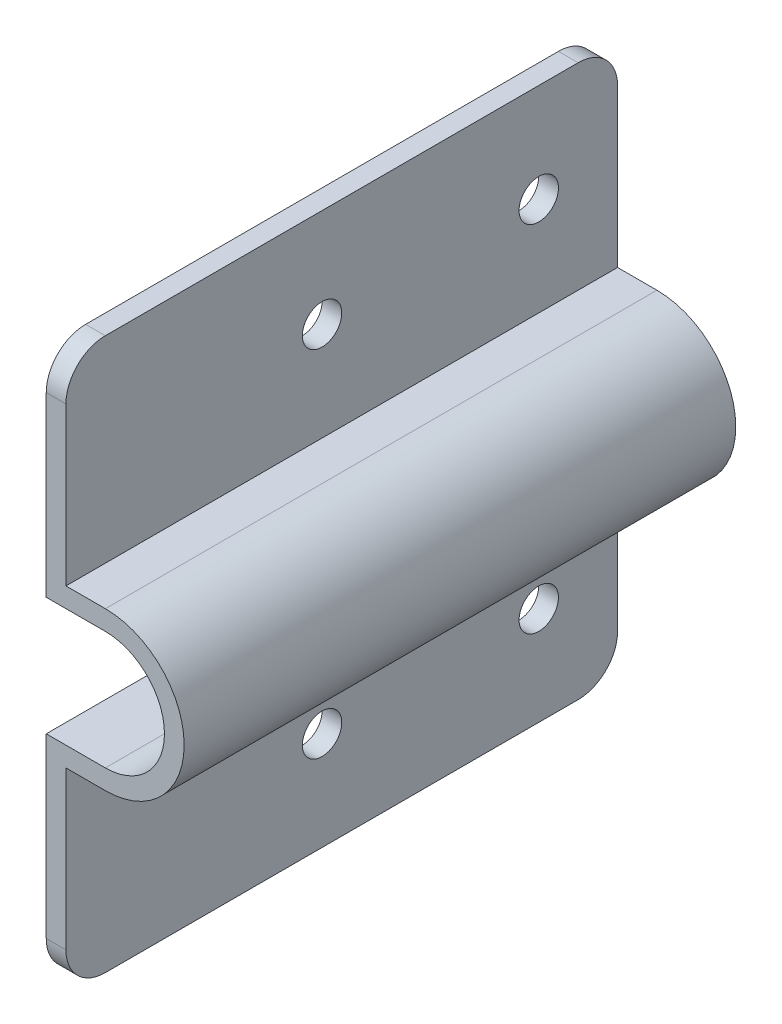
ISO-10303-21;
HEADER;
FILE_DESCRIPTION(('STEP AP214'),'2;1');
FILE_NAME('part.step','',(''),(''),'','','');
FILE_SCHEMA(('AUTOMOTIVE_DESIGN { 1 0 10303 214 1 1 1 1 }'));
ENDSEC;
DATA;
#1=APPLICATION_CONTEXT('core data for automotive mechanical design processes');
#2=APPLICATION_PROTOCOL_DEFINITION('international standard','automotive_design',2000,#1);
#3=PRODUCT_CONTEXT('',#1,'mechanical');
#4=PRODUCT('Part','Part','',(#3));
#5=PRODUCT_RELATED_PRODUCT_CATEGORY('part','',(#4));
#6=PRODUCT_DEFINITION_FORMATION('','',#4);
#7=PRODUCT_DEFINITION_CONTEXT('part definition',#1,'design');
#8=PRODUCT_DEFINITION('design','',#6,#7);
#9=PRODUCT_DEFINITION_SHAPE('','',#8);
#10=(LENGTH_UNIT() NAMED_UNIT(*) SI_UNIT(.MILLI.,.METRE.));
#11=(NAMED_UNIT(*) PLANE_ANGLE_UNIT() SI_UNIT($,.RADIAN.));
#12=(NAMED_UNIT(*) SI_UNIT($,.STERADIAN.) SOLID_ANGLE_UNIT());
#13=UNCERTAINTY_MEASURE_WITH_UNIT(LENGTH_MEASURE(1.E-05),#10,'distance_accuracy_value','');
#14=(GEOMETRIC_REPRESENTATION_CONTEXT(3) GLOBAL_UNCERTAINTY_ASSIGNED_CONTEXT((#13)) GLOBAL_UNIT_ASSIGNED_CONTEXT((#10,
#11,#12)) REPRESENTATION_CONTEXT('',''));
#15=CARTESIAN_POINT('',(0.,0.,0.));
#16=DIRECTION('',(0.,0.,1.));
#17=DIRECTION('',(1.,0.,0.));
#18=AXIS2_PLACEMENT_3D('',#15,#16,#17);
#19=CARTESIAN_POINT('',(0.,288.164397321974,-88.9));
#20=DIRECTION('',(0.,1.,0.));
#21=DIRECTION('',(0.,0.,1.));
#22=AXIS2_PLACEMENT_3D('',#19,#20,#21);
#23=PLANE('',#22);
#24=DIRECTION('',(-1.,0.,0.));
#25=VECTOR('',#24,1.);
#26=CARTESIAN_POINT('',(0.,288.164397321974,0.));
#27=LINE('',#26,#25);
#28=CARTESIAN_POINT('',(19.6849999999996,288.164397321974,0.));
#29=VERTEX_POINT('',#28);
#30=CARTESIAN_POINT('',(10.1599999999996,288.164397321974,0.));
#31=VERTEX_POINT('',#30);
#32=EDGE_CURVE('E221',#29,#31,#27,.T.);
#33=ORIENTED_EDGE('',*,*,#32,.T.);
#34=DIRECTION('',(0.,0.,1.));
#35=VECTOR('',#34,1.);
#36=CARTESIAN_POINT('',(10.1599999999996,288.164397321974,-88.9));
#37=LINE('',#36,#35);
#38=CARTESIAN_POINT('',(10.1599999999996,288.164397321974,-88.9));
#39=VERTEX_POINT('',#38);
#40=EDGE_CURVE('E182',#39,#31,#37,.T.);
#41=ORIENTED_EDGE('',*,*,#40,.F.);
#42=DIRECTION('',(-1.,0.,0.));
#43=VECTOR('',#42,1.);
#44=CARTESIAN_POINT('',(0.,288.164397321974,-88.9));
#45=LINE('',#44,#43);
#46=CARTESIAN_POINT('',(19.6849999999996,288.164397321974,-88.9));
#47=VERTEX_POINT('',#46);
#48=EDGE_CURVE('E161',#47,#39,#45,.T.);
#49=ORIENTED_EDGE('',*,*,#48,.F.);
#50=DIRECTION('',(0.,0.,1.));
#51=VECTOR('',#50,1.);
#52=CARTESIAN_POINT('',(19.6849999999996,288.164397321974,-88.9));
#53=LINE('',#52,#51);
#54=EDGE_CURVE('E170',#47,#29,#53,.T.);
#55=ORIENTED_EDGE('',*,*,#54,.T.);
#56=EDGE_LOOP('',(#33,#41,#49,#55));
#57=FACE_BOUND('',#56,.T.);
#58=ADVANCED_FACE('F40',(#57),#23,.F.);
#59=CARTESIAN_POINT('',(10.1599999999996,0.,-88.9));
#60=DIRECTION('',(-1.,0.,0.));
#61=DIRECTION('',(0.,-1.,0.));
#62=AXIS2_PLACEMENT_3D('',#59,#60,#61);
#63=PLANE('',#62);
#64=CARTESIAN_POINT('',(10.1599999999996,307.214397321974,-41.275));
#65=DIRECTION('',(1.,0.,0.));
#66=DIRECTION('',(0.,0.,-1.));
#67=AXIS2_PLACEMENT_3D('',#64,#65,#66);
#68=CIRCLE('',#67,3.175);
#69=CARTESIAN_POINT('',(10.1599999999996,307.214397321974,-44.45));
#70=VERTEX_POINT('',#69);
#71=EDGE_CURVE('E650',#70,#70,#68,.T.);
#72=ORIENTED_EDGE('',*,*,#71,.T.);
#73=EDGE_LOOP('',(#72));
#74=FACE_BOUND('',#73,.T.);
#75=CARTESIAN_POINT('',(10.1599999999996,307.214397321974,-76.2));
#76=DIRECTION('',(1.,0.,0.));
#77=DIRECTION('',(0.,0.,-1.));
#78=AXIS2_PLACEMENT_3D('',#75,#76,#77);
#79=CIRCLE('',#78,3.175);
#80=CARTESIAN_POINT('',(10.1599999999996,307.214397321974,-79.375));
#81=VERTEX_POINT('',#80);
#82=EDGE_CURVE('E649',#81,#81,#79,.T.);
#83=ORIENTED_EDGE('',*,*,#82,.T.);
#84=EDGE_LOOP('',(#83));
#85=FACE_BOUND('',#84,.T.);
#86=DIRECTION('',(0.,-1.,0.));
#87=VECTOR('',#86,1.);
#88=CARTESIAN_POINT('',(10.1599999999996,0.,0.));
#89=LINE('',#88,#87);
#90=CARTESIAN_POINT('',(10.1599999999996,316.739397321974,0.));
#91=VERTEX_POINT('',#90);
#92=EDGE_CURVE('E184',#91,#31,#89,.T.);
#93=ORIENTED_EDGE('',*,*,#92,.F.);
#94=CARTESIAN_POINT('',(10.1599999999996,316.739397321974,-6.34999999999999));
#95=DIRECTION('',(-1.,0.,0.));
#96=DIRECTION('',(0.,-1.,0.));
#97=AXIS2_PLACEMENT_3D('',#94,#95,#96);
#98=CIRCLE('',#97,6.35);
#99=CARTESIAN_POINT('',(10.1599999999996,323.089397321974,-6.34999999999999));
#100=VERTEX_POINT('',#99);
#101=EDGE_CURVE('E11',#91,#100,#98,.T.);
#102=ORIENTED_EDGE('',*,*,#101,.T.);
#103=DIRECTION('',(0.,0.,1.));
#104=VECTOR('',#103,1.);
#105=CARTESIAN_POINT('',(10.1599999999996,323.089397321974,-88.9));
#106=LINE('',#105,#104);
#107=CARTESIAN_POINT('',(10.1599999999996,323.089397321974,-82.55));
#108=VERTEX_POINT('',#107);
#109=EDGE_CURVE('E256',#108,#100,#106,.T.);
#110=ORIENTED_EDGE('',*,*,#109,.F.);
#111=CARTESIAN_POINT('',(10.1599999999996,316.739397321974,-82.55));
#112=DIRECTION('',(-1.,0.,0.));
#113=DIRECTION('',(0.,-1.,0.));
#114=AXIS2_PLACEMENT_3D('',#111,#112,#113);
#115=CIRCLE('',#114,6.35);
#116=CARTESIAN_POINT('',(10.1599999999996,316.739397321974,-88.9));
#117=VERTEX_POINT('',#116);
#118=EDGE_CURVE('E49',#108,#117,#115,.T.);
#119=ORIENTED_EDGE('',*,*,#118,.T.);
#120=DIRECTION('',(0.,-1.,0.));
#121=VECTOR('',#120,1.);
#122=CARTESIAN_POINT('',(10.1599999999996,0.,-88.9));
#123=LINE('',#122,#121);
#124=EDGE_CURVE('E179',#117,#39,#123,.T.);
#125=ORIENTED_EDGE('',*,*,#124,.T.);
#126=ORIENTED_EDGE('',*,*,#40,.T.);
#127=EDGE_LOOP('',(#93,#102,#110,#119,#125,#126));
#128=FACE_BOUND('',#127,.T.);
#129=ADVANCED_FACE('F334',(#74,#85,#128),#63,.T.);
#130=CARTESIAN_POINT('',(0.,323.089397321974,-88.9));
#131=DIRECTION('',(0.,-1.,0.));
#132=DIRECTION('',(0.,0.,-1.));
#133=AXIS2_PLACEMENT_3D('',#130,#131,#132);
#134=PLANE('',#133);
#135=ORIENTED_EDGE('',*,*,#109,.T.);
#136=DIRECTION('',(1.,0.,0.));
#137=VECTOR('',#136,1.);
#138=CARTESIAN_POINT('',(13.3349999999996,323.089397321974,-6.34999999999999));
#139=LINE('',#138,#137);
#140=CARTESIAN_POINT('',(13.3349999999996,323.089397321974,-6.34999999999999));
#141=VERTEX_POINT('',#140);
#142=EDGE_CURVE('E323',#100,#141,#139,.T.);
#143=ORIENTED_EDGE('',*,*,#142,.T.);
#144=DIRECTION('',(0.,0.,1.));
#145=VECTOR('',#144,1.);
#146=CARTESIAN_POINT('',(13.3349999999996,323.089397321974,-88.9));
#147=LINE('',#146,#145);
#148=CARTESIAN_POINT('',(13.3349999999996,323.089397321974,-82.55));
#149=VERTEX_POINT('',#148);
#150=EDGE_CURVE('E259',#149,#141,#147,.T.);
#151=ORIENTED_EDGE('',*,*,#150,.F.);
#152=DIRECTION('',(1.,0.,0.));
#153=VECTOR('',#152,1.);
#154=CARTESIAN_POINT('',(0.,323.089397321974,-82.55));
#155=LINE('',#154,#153);
#156=EDGE_CURVE('E61',#149,#108,#155,.F.);
#157=ORIENTED_EDGE('',*,*,#156,.T.);
#158=EDGE_LOOP('',(#135,#143,#151,#157));
#159=FACE_BOUND('',#158,.T.);
#160=ADVANCED_FACE('F340',(#159),#134,.F.);
#161=CARTESIAN_POINT('',(13.3349999999996,0.,-88.9));
#162=DIRECTION('',(1.,0.,0.));
#163=DIRECTION('',(0.,0.,-1.));
#164=AXIS2_PLACEMENT_3D('',#161,#162,#163);
#165=PLANE('',#164);
#166=CARTESIAN_POINT('',(13.3349999999996,307.214397321974,-41.275));
#167=DIRECTION('',(1.,0.,0.));
#168=DIRECTION('',(0.,0.,-1.));
#169=AXIS2_PLACEMENT_3D('',#166,#167,#168);
#170=CIRCLE('',#169,3.175);
#171=CARTESIAN_POINT('',(13.3349999999996,307.214397321974,-44.45));
#172=VERTEX_POINT('',#171);
#173=EDGE_CURVE('E643',#172,#172,#170,.T.);
#174=ORIENTED_EDGE('',*,*,#173,.F.);
#175=EDGE_LOOP('',(#174));
#176=FACE_BOUND('',#175,.T.);
#177=CARTESIAN_POINT('',(13.3349999999996,307.214397321974,-76.2));
#178=DIRECTION('',(1.,0.,0.));
#179=DIRECTION('',(0.,0.,-1.));
#180=AXIS2_PLACEMENT_3D('',#177,#178,#179);
#181=CIRCLE('',#180,3.175);
#182=CARTESIAN_POINT('',(13.3349999999996,307.214397321974,-79.375));
#183=VERTEX_POINT('',#182);
#184=EDGE_CURVE('E646',#183,#183,#181,.T.);
#185=ORIENTED_EDGE('',*,*,#184,.F.);
#186=EDGE_LOOP('',(#185));
#187=FACE_BOUND('',#186,.T.);
#188=ORIENTED_EDGE('',*,*,#150,.T.);
#189=CARTESIAN_POINT('',(13.3349999999996,316.739397321974,-6.34999999999999));
#190=DIRECTION('',(1.,0.,0.));
#191=DIRECTION('',(0.,0.,-1.));
#192=AXIS2_PLACEMENT_3D('',#189,#190,#191);
#193=CIRCLE('',#192,6.35);
#194=CARTESIAN_POINT('',(13.3349999999996,316.739397321974,0.));
#195=VERTEX_POINT('',#194);
#196=EDGE_CURVE('E329',#141,#195,#193,.T.);
#197=ORIENTED_EDGE('',*,*,#196,.T.);
#198=DIRECTION('',(0.,1.,0.));
#199=VECTOR('',#198,1.);
#200=CARTESIAN_POINT('',(13.3349999999996,0.,0.));
#201=LINE('',#200,#199);
#202=CARTESIAN_POINT('',(13.3349999999996,291.339397321974,0.));
#203=VERTEX_POINT('',#202);
#204=EDGE_CURVE('E188',#203,#195,#201,.T.);
#205=ORIENTED_EDGE('',*,*,#204,.F.);
#206=DIRECTION('',(0.,0.,1.));
#207=VECTOR('',#206,1.);
#208=CARTESIAN_POINT('',(13.3349999999996,291.339397321974,-88.9));
#209=LINE('',#208,#207);
#210=CARTESIAN_POINT('',(13.3349999999996,291.339397321974,-88.9));
#211=VERTEX_POINT('',#210);
#212=EDGE_CURVE('E263',#211,#203,#209,.T.);
#213=ORIENTED_EDGE('',*,*,#212,.F.);
#214=DIRECTION('',(0.,1.,0.));
#215=VECTOR('',#214,1.);
#216=CARTESIAN_POINT('',(13.3349999999996,0.,-88.9));
#217=LINE('',#216,#215);
#218=CARTESIAN_POINT('',(13.3349999999996,316.739397321974,-88.9));
#219=VERTEX_POINT('',#218);
#220=EDGE_CURVE('E215',#211,#219,#217,.T.);
#221=ORIENTED_EDGE('',*,*,#220,.T.);
#222=CARTESIAN_POINT('',(13.3349999999996,316.739397321974,-82.55));
#223=DIRECTION('',(1.,0.,0.));
#224=DIRECTION('',(0.,0.,-1.));
#225=AXIS2_PLACEMENT_3D('',#222,#223,#224);
#226=CIRCLE('',#225,6.35);
#227=EDGE_CURVE('E326',#219,#149,#226,.T.);
#228=ORIENTED_EDGE('',*,*,#227,.T.);
#229=EDGE_LOOP('',(#188,#197,#205,#213,#221,#228));
#230=FACE_BOUND('',#229,.T.);
#231=ADVANCED_FACE('F339',(#176,#187,#230),#165,.T.);
#232=CARTESIAN_POINT('',(0.,291.339397321974,-88.9));
#233=DIRECTION('',(0.,1.,0.));
#234=DIRECTION('',(0.,0.,1.));
#235=AXIS2_PLACEMENT_3D('',#232,#233,#234);
#236=PLANE('',#235);
#237=DIRECTION('',(-1.,0.,0.));
#238=VECTOR('',#237,1.);
#239=CARTESIAN_POINT('',(0.,291.339397321974,0.));
#240=LINE('',#239,#238);
#241=CARTESIAN_POINT('',(19.6849999999996,291.339397321974,0.));
#242=VERTEX_POINT('',#241);
#243=EDGE_CURVE('E246',#242,#203,#240,.T.);
#244=ORIENTED_EDGE('',*,*,#243,.F.);
#245=DIRECTION('',(0.,0.,1.));
#246=VECTOR('',#245,1.);
#247=CARTESIAN_POINT('',(19.6849999999996,291.339397321974,-88.9));
#248=LINE('',#247,#246);
#249=CARTESIAN_POINT('',(19.6849999999996,291.339397321974,-88.9));
#250=VERTEX_POINT('',#249);
#251=EDGE_CURVE('E266',#250,#242,#248,.T.);
#252=ORIENTED_EDGE('',*,*,#251,.F.);
#253=DIRECTION('',(-1.,0.,0.));
#254=VECTOR('',#253,1.);
#255=CARTESIAN_POINT('',(0.,291.339397321974,-88.9));
#256=LINE('',#255,#254);
#257=EDGE_CURVE('E211',#250,#211,#256,.T.);
#258=ORIENTED_EDGE('',*,*,#257,.T.);
#259=ORIENTED_EDGE('',*,*,#212,.T.);
#260=EDGE_LOOP('',(#244,#252,#258,#259));
#261=FACE_BOUND('',#260,.T.);
#262=ADVANCED_FACE('F352',(#261),#236,.T.);
#263=CARTESIAN_POINT('',(19.6849999999996,278.639397321974,-88.9));
#264=DIRECTION('',(0.,0.,1.));
#265=DIRECTION('',(1.,0.,0.));
#266=AXIS2_PLACEMENT_3D('',#263,#264,#265);
#267=CYLINDRICAL_SURFACE('',#266,12.7);
#268=CARTESIAN_POINT('',(19.6849999999996,278.639397321974,0.));
#269=DIRECTION('',(0.,0.,1.));
#270=DIRECTION('',(1.,0.,0.));
#271=AXIS2_PLACEMENT_3D('',#268,#269,#270);
#272=CIRCLE('',#271,12.7);
#273=CARTESIAN_POINT('',(19.6849999999996,265.939397321974,0.));
#274=VERTEX_POINT('',#273);
#275=EDGE_CURVE('E242',#274,#242,#272,.T.);
#276=ORIENTED_EDGE('',*,*,#275,.F.);
#277=DIRECTION('',(0.,0.,1.));
#278=VECTOR('',#277,1.);
#279=CARTESIAN_POINT('',(19.6849999999996,265.939397321974,-88.9));
#280=LINE('',#279,#278);
#281=CARTESIAN_POINT('',(19.6849999999996,265.939397321974,-88.9));
#282=VERTEX_POINT('',#281);
#283=EDGE_CURVE('E269',#282,#274,#280,.T.);
#284=ORIENTED_EDGE('',*,*,#283,.F.);
#285=CARTESIAN_POINT('',(19.6849999999996,278.639397321974,-88.9));
#286=DIRECTION('',(0.,0.,1.));
#287=DIRECTION('',(1.,0.,0.));
#288=AXIS2_PLACEMENT_3D('',#285,#286,#287);
#289=CIRCLE('',#288,12.7);
#290=EDGE_CURVE('E207',#282,#250,#289,.T.);
#291=ORIENTED_EDGE('',*,*,#290,.T.);
#292=ORIENTED_EDGE('',*,*,#251,.T.);
#293=EDGE_LOOP('',(#276,#284,#291,#292));
#294=FACE_BOUND('',#293,.T.);
#295=ADVANCED_FACE('F356',(#294),#267,.T.);
#296=CARTESIAN_POINT('',(0.,265.939397321974,-88.9));
#297=DIRECTION('',(0.,1.,0.));
#298=DIRECTION('',(0.,0.,1.));
#299=AXIS2_PLACEMENT_3D('',#296,#297,#298);
#300=PLANE('',#299);
#301=DIRECTION('',(-1.,0.,0.));
#302=VECTOR('',#301,1.);
#303=CARTESIAN_POINT('',(0.,265.939397321974,0.));
#304=LINE('',#303,#302);
#305=CARTESIAN_POINT('',(13.3349999999996,265.939397321974,0.));
#306=VERTEX_POINT('',#305);
#307=EDGE_CURVE('E238',#274,#306,#304,.T.);
#308=ORIENTED_EDGE('',*,*,#307,.T.);
#309=DIRECTION('',(0.,0.,1.));
#310=VECTOR('',#309,1.);
#311=CARTESIAN_POINT('',(13.3349999999996,265.939397321974,-88.9));
#312=LINE('',#311,#310);
#313=CARTESIAN_POINT('',(13.3349999999996,265.939397321974,-88.9));
#314=VERTEX_POINT('',#313);
#315=EDGE_CURVE('E272',#314,#306,#312,.T.);
#316=ORIENTED_EDGE('',*,*,#315,.F.);
#317=DIRECTION('',(-1.,0.,0.));
#318=VECTOR('',#317,1.);
#319=CARTESIAN_POINT('',(0.,265.939397321974,-88.9));
#320=LINE('',#319,#318);
#321=EDGE_CURVE('E203',#282,#314,#320,.T.);
#322=ORIENTED_EDGE('',*,*,#321,.F.);
#323=ORIENTED_EDGE('',*,*,#283,.T.);
#324=EDGE_LOOP('',(#308,#316,#322,#323));
#325=FACE_BOUND('',#324,.T.);
#326=ADVANCED_FACE('F360',(#325),#300,.F.);
#327=CARTESIAN_POINT('',(13.3349999999996,0.,-88.9));
#328=DIRECTION('',(1.,0.,0.));
#329=DIRECTION('',(0.,0.,-1.));
#330=AXIS2_PLACEMENT_3D('',#327,#328,#329);
#331=PLANE('',#330);
#332=CARTESIAN_POINT('',(13.3349999999996,250.064397321974,-76.2));
#333=DIRECTION('',(1.,0.,0.));
#334=DIRECTION('',(0.,0.,-1.));
#335=AXIS2_PLACEMENT_3D('',#332,#333,#334);
#336=CIRCLE('',#335,3.175);
#337=CARTESIAN_POINT('',(13.3349999999996,250.064397321974,-79.375));
#338=VERTEX_POINT('',#337);
#339=EDGE_CURVE('E654',#338,#338,#336,.T.);
#340=ORIENTED_EDGE('',*,*,#339,.F.);
#341=EDGE_LOOP('',(#340));
#342=FACE_BOUND('',#341,.T.);
#343=CARTESIAN_POINT('',(13.3349999999996,250.064397321974,-41.275));
#344=DIRECTION('',(1.,0.,0.));
#345=DIRECTION('',(0.,0.,-1.));
#346=AXIS2_PLACEMENT_3D('',#343,#344,#345);
#347=CIRCLE('',#346,3.175);
#348=CARTESIAN_POINT('',(13.3349999999996,250.064397321974,-44.45));
#349=VERTEX_POINT('',#348);
#350=EDGE_CURVE('E191',#349,#349,#347,.T.);
#351=ORIENTED_EDGE('',*,*,#350,.F.);
#352=EDGE_LOOP('',(#351));
#353=FACE_BOUND('',#352,.T.);
#354=DIRECTION('',(0.,1.,0.));
#355=VECTOR('',#354,1.);
#356=CARTESIAN_POINT('',(13.3349999999996,0.,0.));
#357=LINE('',#356,#355);
#358=CARTESIAN_POINT('',(13.3349999999996,240.539397321974,0.));
#359=VERTEX_POINT('',#358);
#360=EDGE_CURVE('E235',#359,#306,#357,.T.);
#361=ORIENTED_EDGE('',*,*,#360,.F.);
#362=CARTESIAN_POINT('',(13.3349999999996,240.539397321974,-6.35));
#363=DIRECTION('',(1.,0.,0.));
#364=DIRECTION('',(0.,0.,-1.));
#365=AXIS2_PLACEMENT_3D('',#362,#363,#364);
#366=CIRCLE('',#365,6.35);
#367=CARTESIAN_POINT('',(13.3349999999996,234.189397321974,-6.34999999999999));
#368=VERTEX_POINT('',#367);
#369=EDGE_CURVE('E298',#359,#368,#366,.T.);
#370=ORIENTED_EDGE('',*,*,#369,.T.);
#371=DIRECTION('',(0.,0.,1.));
#372=VECTOR('',#371,1.);
#373=CARTESIAN_POINT('',(13.3349999999996,234.189397321974,-88.9));
#374=LINE('',#373,#372);
#375=CARTESIAN_POINT('',(13.3349999999996,234.189397321974,-82.55));
#376=VERTEX_POINT('',#375);
#377=EDGE_CURVE('E276',#376,#368,#374,.T.);
#378=ORIENTED_EDGE('',*,*,#377,.F.);
#379=CARTESIAN_POINT('',(13.3349999999996,240.539397321974,-82.55));
#380=DIRECTION('',(1.,0.,0.));
#381=DIRECTION('',(0.,0.,-1.));
#382=AXIS2_PLACEMENT_3D('',#379,#380,#381);
#383=CIRCLE('',#382,6.35);
#384=CARTESIAN_POINT('',(13.3349999999996,240.539397321974,-88.9));
#385=VERTEX_POINT('',#384);
#386=EDGE_CURVE('E295',#376,#385,#383,.T.);
#387=ORIENTED_EDGE('',*,*,#386,.T.);
#388=DIRECTION('',(0.,1.,0.));
#389=VECTOR('',#388,1.);
#390=CARTESIAN_POINT('',(13.3349999999996,0.,-88.9));
#391=LINE('',#390,#389);
#392=EDGE_CURVE('E200',#385,#314,#391,.T.);
#393=ORIENTED_EDGE('',*,*,#392,.T.);
#394=ORIENTED_EDGE('',*,*,#315,.T.);
#395=EDGE_LOOP('',(#361,#370,#378,#387,#393,#394));
#396=FACE_BOUND('',#395,.T.);
#397=ADVANCED_FACE('F494',(#342,#353,#396),#331,.T.);
#398=CARTESIAN_POINT('',(0.,234.189397321974,-88.9));
#399=DIRECTION('',(0.,-1.,0.));
#400=DIRECTION('',(0.,0.,-1.));
#401=AXIS2_PLACEMENT_3D('',#398,#399,#400);
#402=PLANE('',#401);
#403=ORIENTED_EDGE('',*,*,#377,.T.);
#404=DIRECTION('',(1.,0.,0.));
#405=VECTOR('',#404,1.);
#406=CARTESIAN_POINT('',(0.,234.189397321974,-6.34999999999999));
#407=LINE('',#406,#405);
#408=CARTESIAN_POINT('',(10.1599999999996,234.189397321974,-6.34999999999999));
#409=VERTEX_POINT('',#408);
#410=EDGE_CURVE('E305',#368,#409,#407,.F.);
#411=ORIENTED_EDGE('',*,*,#410,.T.);
#412=DIRECTION('',(0.,0.,1.));
#413=VECTOR('',#412,1.);
#414=CARTESIAN_POINT('',(10.1599999999996,234.189397321974,-88.9));
#415=LINE('',#414,#413);
#416=CARTESIAN_POINT('',(10.1599999999996,234.189397321974,-82.55));
#417=VERTEX_POINT('',#416);
#418=EDGE_CURVE('E280',#417,#409,#415,.T.);
#419=ORIENTED_EDGE('',*,*,#418,.F.);
#420=DIRECTION('',(1.,0.,0.));
#421=VECTOR('',#420,1.);
#422=CARTESIAN_POINT('',(13.3349999999996,234.189397321974,-82.55));
#423=LINE('',#422,#421);
#424=EDGE_CURVE('E301',#417,#376,#423,.T.);
#425=ORIENTED_EDGE('',*,*,#424,.T.);
#426=EDGE_LOOP('',(#403,#411,#419,#425));
#427=FACE_BOUND('',#426,.T.);
#428=ADVANCED_FACE('F372',(#427),#402,.T.);
#429=CARTESIAN_POINT('',(10.1599999999996,0.,-88.9));
#430=DIRECTION('',(-1.,0.,0.));
#431=DIRECTION('',(0.,-1.,0.));
#432=AXIS2_PLACEMENT_3D('',#429,#430,#431);
#433=PLANE('',#432);
#434=CARTESIAN_POINT('',(10.1599999999996,250.064397321974,-76.2));
#435=DIRECTION('',(1.,0.,0.));
#436=DIRECTION('',(0.,0.,-1.));
#437=AXIS2_PLACEMENT_3D('',#434,#435,#436);
#438=CIRCLE('',#437,3.175);
#439=CARTESIAN_POINT('',(10.1599999999996,250.064397321974,-79.375));
#440=VERTEX_POINT('',#439);
#441=EDGE_CURVE('E669',#440,#440,#438,.T.);
#442=ORIENTED_EDGE('',*,*,#441,.T.);
#443=EDGE_LOOP('',(#442));
#444=FACE_BOUND('',#443,.T.);
#445=CARTESIAN_POINT('',(10.1599999999996,250.064397321974,-41.275));
#446=DIRECTION('',(1.,0.,0.));
#447=DIRECTION('',(0.,0.,-1.));
#448=AXIS2_PLACEMENT_3D('',#445,#446,#447);
#449=CIRCLE('',#448,3.175);
#450=CARTESIAN_POINT('',(10.1599999999996,250.064397321974,-44.45));
#451=VERTEX_POINT('',#450);
#452=EDGE_CURVE('E224',#451,#451,#449,.T.);
#453=ORIENTED_EDGE('',*,*,#452,.T.);
#454=EDGE_LOOP('',(#453));
#455=FACE_BOUND('',#454,.T.);
#456=ORIENTED_EDGE('',*,*,#418,.T.);
#457=CARTESIAN_POINT('',(10.1599999999996,240.539397321974,-6.35));
#458=DIRECTION('',(-1.,0.,0.));
#459=DIRECTION('',(0.,-1.,0.));
#460=AXIS2_PLACEMENT_3D('',#457,#458,#459);
#461=CIRCLE('',#460,6.35);
#462=CARTESIAN_POINT('',(10.1599999999996,240.539397321974,0.));
#463=VERTEX_POINT('',#462);
#464=EDGE_CURVE('E311',#409,#463,#461,.T.);
#465=ORIENTED_EDGE('',*,*,#464,.T.);
#466=DIRECTION('',(0.,-1.,0.));
#467=VECTOR('',#466,1.);
#468=CARTESIAN_POINT('',(10.1599999999996,0.,0.));
#469=LINE('',#468,#467);
#470=CARTESIAN_POINT('',(10.1599999999996,269.114397321974,0.));
#471=VERTEX_POINT('',#470);
#472=EDGE_CURVE('E231',#471,#463,#469,.T.);
#473=ORIENTED_EDGE('',*,*,#472,.F.);
#474=DIRECTION('',(0.,0.,1.));
#475=VECTOR('',#474,1.);
#476=CARTESIAN_POINT('',(10.1599999999996,269.114397321974,-88.9));
#477=LINE('',#476,#475);
#478=CARTESIAN_POINT('',(10.1599999999996,269.114397321974,-88.9));
#479=VERTEX_POINT('',#478);
#480=EDGE_CURVE('E284',#479,#471,#477,.T.);
#481=ORIENTED_EDGE('',*,*,#480,.F.);
#482=DIRECTION('',(0.,-1.,0.));
#483=VECTOR('',#482,1.);
#484=CARTESIAN_POINT('',(10.1599999999996,0.,-88.9));
#485=LINE('',#484,#483);
#486=CARTESIAN_POINT('',(10.1599999999996,240.539397321974,-88.9));
#487=VERTEX_POINT('',#486);
#488=EDGE_CURVE('E196',#479,#487,#485,.T.);
#489=ORIENTED_EDGE('',*,*,#488,.T.);
#490=CARTESIAN_POINT('',(10.1599999999996,240.539397321974,-82.55));
#491=DIRECTION('',(-1.,0.,0.));
#492=DIRECTION('',(0.,-1.,0.));
#493=AXIS2_PLACEMENT_3D('',#490,#491,#492);
#494=CIRCLE('',#493,6.35);
#495=EDGE_CURVE('E308',#487,#417,#494,.T.);
#496=ORIENTED_EDGE('',*,*,#495,.T.);
#497=EDGE_LOOP('',(#456,#465,#473,#481,#489,#496));
#498=FACE_BOUND('',#497,.T.);
#499=ADVANCED_FACE('F369',(#444,#455,#498),#433,.T.);
#500=CARTESIAN_POINT('',(0.,269.114397321974,-88.9));
#501=DIRECTION('',(0.,1.,0.));
#502=DIRECTION('',(0.,0.,1.));
#503=AXIS2_PLACEMENT_3D('',#500,#501,#502);
#504=PLANE('',#503);
#505=DIRECTION('',(-1.,0.,0.));
#506=VECTOR('',#505,1.);
#507=CARTESIAN_POINT('',(0.,269.114397321974,0.));
#508=LINE('',#507,#506);
#509=CARTESIAN_POINT('',(19.6849999999996,269.114397321974,0.));
#510=VERTEX_POINT('',#509);
#511=EDGE_CURVE('E227',#510,#471,#508,.T.);
#512=ORIENTED_EDGE('',*,*,#511,.F.);
#513=DIRECTION('',(0.,0.,1.));
#514=VECTOR('',#513,1.);
#515=CARTESIAN_POINT('',(19.6849999999996,269.114397321974,-88.9));
#516=LINE('',#515,#514);
#517=CARTESIAN_POINT('',(19.6849999999996,269.114397321974,-88.9));
#518=VERTEX_POINT('',#517);
#519=EDGE_CURVE('E178',#518,#510,#516,.T.);
#520=ORIENTED_EDGE('',*,*,#519,.F.);
#521=DIRECTION('',(-1.,0.,0.));
#522=VECTOR('',#521,1.);
#523=CARTESIAN_POINT('',(0.,269.114397321974,-88.9));
#524=LINE('',#523,#522);
#525=EDGE_CURVE('E165',#518,#479,#524,.T.);
#526=ORIENTED_EDGE('',*,*,#525,.T.);
#527=ORIENTED_EDGE('',*,*,#480,.T.);
#528=EDGE_LOOP('',(#512,#520,#526,#527));
#529=FACE_BOUND('',#528,.T.);
#530=ADVANCED_FACE('F382',(#529),#504,.T.);
#531=CARTESIAN_POINT('',(19.6849999999996,278.639397321974,-88.9));
#532=DIRECTION('',(0.,0.,1.));
#533=DIRECTION('',(1.,0.,0.));
#534=AXIS2_PLACEMENT_3D('',#531,#532,#533);
#535=CYLINDRICAL_SURFACE('',#534,9.525);
#536=CARTESIAN_POINT('',(19.6849999999996,278.639397321974,0.));
#537=DIRECTION('',(0.,0.,1.));
#538=DIRECTION('',(1.,0.,0.));
#539=AXIS2_PLACEMENT_3D('',#536,#537,#538);
#540=CIRCLE('',#539,9.525);
#541=EDGE_CURVE('E173',#510,#29,#540,.T.);
#542=ORIENTED_EDGE('',*,*,#541,.T.);
#543=ORIENTED_EDGE('',*,*,#54,.F.);
#544=CARTESIAN_POINT('',(19.6849999999996,278.639397321974,-88.9));
#545=DIRECTION('',(0.,0.,1.));
#546=DIRECTION('',(1.,0.,0.));
#547=AXIS2_PLACEMENT_3D('',#544,#545,#546);
#548=CIRCLE('',#547,9.525);
#549=EDGE_CURVE('E155',#518,#47,#548,.T.);
#550=ORIENTED_EDGE('',*,*,#549,.F.);
#551=ORIENTED_EDGE('',*,*,#519,.T.);
#552=EDGE_LOOP('',(#542,#543,#550,#551));
#553=FACE_BOUND('',#552,.T.);
#554=ADVANCED_FACE('F171',(#553),#535,.F.);
#555=CARTESIAN_POINT('',(0.,0.,-88.9));
#556=DIRECTION('',(0.,0.,1.));
#557=DIRECTION('',(1.,0.,0.));
#558=AXIS2_PLACEMENT_3D('',#555,#556,#557);
#559=PLANE('',#558);
#560=ORIENTED_EDGE('',*,*,#392,.F.);
#561=DIRECTION('',(1.,0.,0.));
#562=VECTOR('',#561,1.);
#563=CARTESIAN_POINT('',(10.1599999999996,240.539397321974,-88.9));
#564=LINE('',#563,#562);
#565=EDGE_CURVE('E318',#385,#487,#564,.F.);
#566=ORIENTED_EDGE('',*,*,#565,.T.);
#567=ORIENTED_EDGE('',*,*,#488,.F.);
#568=ORIENTED_EDGE('',*,*,#525,.F.);
#569=ORIENTED_EDGE('',*,*,#549,.T.);
#570=ORIENTED_EDGE('',*,*,#48,.T.);
#571=ORIENTED_EDGE('',*,*,#124,.F.);
#572=DIRECTION('',(1.,0.,0.));
#573=VECTOR('',#572,1.);
#574=CARTESIAN_POINT('',(0.,316.739397321974,-88.9));
#575=LINE('',#574,#573);
#576=EDGE_CURVE('E314',#117,#219,#575,.T.);
#577=ORIENTED_EDGE('',*,*,#576,.T.);
#578=ORIENTED_EDGE('',*,*,#220,.F.);
#579=ORIENTED_EDGE('',*,*,#257,.F.);
#580=ORIENTED_EDGE('',*,*,#290,.F.);
#581=ORIENTED_EDGE('',*,*,#321,.T.);
#582=EDGE_LOOP('',(#560,#566,#567,#568,#569,#570,#571,#577,#578,#579,#580,#581));
#583=FACE_BOUND('',#582,.T.);
#584=ADVANCED_FACE('F158',(#583),#559,.F.);
#585=CARTESIAN_POINT('',(0.,0.,0.));
#586=DIRECTION('',(0.,0.,1.));
#587=DIRECTION('',(1.,0.,0.));
#588=AXIS2_PLACEMENT_3D('',#585,#586,#587);
#589=PLANE('',#588);
#590=ORIENTED_EDGE('',*,*,#472,.T.);
#591=DIRECTION('',(1.,0.,0.));
#592=VECTOR('',#591,1.);
#593=CARTESIAN_POINT('',(0.,240.539397321974,0.));
#594=LINE('',#593,#592);
#595=EDGE_CURVE('E291',#463,#359,#594,.T.);
#596=ORIENTED_EDGE('',*,*,#595,.T.);
#597=ORIENTED_EDGE('',*,*,#360,.T.);
#598=ORIENTED_EDGE('',*,*,#307,.F.);
#599=ORIENTED_EDGE('',*,*,#275,.T.);
#600=ORIENTED_EDGE('',*,*,#243,.T.);
#601=ORIENTED_EDGE('',*,*,#204,.T.);
#602=DIRECTION('',(1.,0.,0.));
#603=VECTOR('',#602,1.);
#604=CARTESIAN_POINT('',(10.1599999999996,316.739397321974,0.));
#605=LINE('',#604,#603);
#606=EDGE_CURVE('E255',#195,#91,#605,.F.);
#607=ORIENTED_EDGE('',*,*,#606,.T.);
#608=ORIENTED_EDGE('',*,*,#92,.T.);
#609=ORIENTED_EDGE('',*,*,#32,.F.);
#610=ORIENTED_EDGE('',*,*,#541,.F.);
#611=ORIENTED_EDGE('',*,*,#511,.T.);
#612=EDGE_LOOP('',(#590,#596,#597,#598,#599,#600,#601,#607,#608,#609,#610,#611));
#613=FACE_BOUND('',#612,.T.);
#614=ADVANCED_FACE('F347',(#613),#589,.T.);
#615=CARTESIAN_POINT('',(10.1599999999996,250.064397321974,-41.275));
#616=DIRECTION('',(1.,0.,0.));
#617=DIRECTION('',(0.,0.,-1.));
#618=AXIS2_PLACEMENT_3D('',#615,#616,#617);
#619=CYLINDRICAL_SURFACE('',#618,3.175);
#620=ORIENTED_EDGE('',*,*,#452,.F.);
#621=EDGE_LOOP('',(#620));
#622=FACE_BOUND('',#621,.T.);
#623=ORIENTED_EDGE('',*,*,#350,.T.);
#624=EDGE_LOOP('',(#623));
#625=FACE_BOUND('',#624,.T.);
#626=ADVANCED_FACE('F450',(#622,#625),#619,.F.);
#627=CARTESIAN_POINT('',(10.1599999999996,250.064397321974,-76.2));
#628=DIRECTION('',(1.,0.,0.));
#629=DIRECTION('',(0.,0.,-1.));
#630=AXIS2_PLACEMENT_3D('',#627,#628,#629);
#631=CYLINDRICAL_SURFACE('',#630,3.175);
#632=ORIENTED_EDGE('',*,*,#441,.F.);
#633=EDGE_LOOP('',(#632));
#634=FACE_BOUND('',#633,.T.);
#635=ORIENTED_EDGE('',*,*,#339,.T.);
#636=EDGE_LOOP('',(#635));
#637=FACE_BOUND('',#636,.T.);
#638=ADVANCED_FACE('F441',(#634,#637),#631,.F.);
#639=CARTESIAN_POINT('',(10.1599999999996,307.214397321974,-76.2));
#640=DIRECTION('',(1.,0.,0.));
#641=DIRECTION('',(0.,0.,-1.));
#642=AXIS2_PLACEMENT_3D('',#639,#640,#641);
#643=CYLINDRICAL_SURFACE('',#642,3.175);
#644=ORIENTED_EDGE('',*,*,#82,.F.);
#645=EDGE_LOOP('',(#644));
#646=FACE_BOUND('',#645,.T.);
#647=ORIENTED_EDGE('',*,*,#184,.T.);
#648=EDGE_LOOP('',(#647));
#649=FACE_BOUND('',#648,.T.);
#650=ADVANCED_FACE('F431',(#646,#649),#643,.F.);
#651=CARTESIAN_POINT('',(10.1599999999996,307.214397321974,-41.275));
#652=DIRECTION('',(1.,0.,0.));
#653=DIRECTION('',(0.,0.,-1.));
#654=AXIS2_PLACEMENT_3D('',#651,#652,#653);
#655=CYLINDRICAL_SURFACE('',#654,3.175);
#656=ORIENTED_EDGE('',*,*,#71,.F.);
#657=EDGE_LOOP('',(#656));
#658=FACE_BOUND('',#657,.T.);
#659=ORIENTED_EDGE('',*,*,#173,.T.);
#660=EDGE_LOOP('',(#659));
#661=FACE_BOUND('',#660,.T.);
#662=ADVANCED_FACE('F402',(#658,#661),#655,.F.);
#663=CARTESIAN_POINT('',(0.,240.539397321974,-6.35));
#664=DIRECTION('',(1.,0.,0.));
#665=DIRECTION('',(0.,0.,-1.));
#666=AXIS2_PLACEMENT_3D('',#663,#664,#665);
#667=CYLINDRICAL_SURFACE('',#666,6.35);
#668=ORIENTED_EDGE('',*,*,#464,.F.);
#669=ORIENTED_EDGE('',*,*,#410,.F.);
#670=ORIENTED_EDGE('',*,*,#369,.F.);
#671=ORIENTED_EDGE('',*,*,#595,.F.);
#672=EDGE_LOOP('',(#668,#669,#670,#671));
#673=FACE_BOUND('',#672,.T.);
#674=ADVANCED_FACE('F376',(#673),#667,.T.);
#675=CARTESIAN_POINT('',(0.,240.539397321974,-82.55));
#676=DIRECTION('',(-1.,0.,0.));
#677=DIRECTION('',(0.,0.,1.));
#678=AXIS2_PLACEMENT_3D('',#675,#676,#677);
#679=CYLINDRICAL_SURFACE('',#678,6.35);
#680=ORIENTED_EDGE('',*,*,#495,.F.);
#681=ORIENTED_EDGE('',*,*,#565,.F.);
#682=ORIENTED_EDGE('',*,*,#386,.F.);
#683=ORIENTED_EDGE('',*,*,#424,.F.);
#684=EDGE_LOOP('',(#680,#681,#682,#683));
#685=FACE_BOUND('',#684,.T.);
#686=ADVANCED_FACE('F365',(#685),#679,.T.);
#687=CARTESIAN_POINT('',(0.,316.739397321974,-6.34999999999999));
#688=DIRECTION('',(-1.,0.,0.));
#689=DIRECTION('',(0.,0.,1.));
#690=AXIS2_PLACEMENT_3D('',#687,#688,#689);
#691=CYLINDRICAL_SURFACE('',#690,6.35);
#692=ORIENTED_EDGE('',*,*,#101,.F.);
#693=ORIENTED_EDGE('',*,*,#606,.F.);
#694=ORIENTED_EDGE('',*,*,#196,.F.);
#695=ORIENTED_EDGE('',*,*,#142,.F.);
#696=EDGE_LOOP('',(#692,#693,#694,#695));
#697=FACE_BOUND('',#696,.T.);
#698=ADVANCED_FACE('F343',(#697),#691,.T.);
#699=CARTESIAN_POINT('',(0.,316.739397321974,-82.55));
#700=DIRECTION('',(1.,0.,0.));
#701=DIRECTION('',(0.,0.,-1.));
#702=AXIS2_PLACEMENT_3D('',#699,#700,#701);
#703=CYLINDRICAL_SURFACE('',#702,6.35);
#704=ORIENTED_EDGE('',*,*,#118,.F.);
#705=ORIENTED_EDGE('',*,*,#156,.F.);
#706=ORIENTED_EDGE('',*,*,#227,.F.);
#707=ORIENTED_EDGE('',*,*,#576,.F.);
#708=EDGE_LOOP('',(#704,#705,#706,#707));
#709=FACE_BOUND('',#708,.T.);
#710=ADVANCED_FACE('F42',(#709),#703,.T.);
#711=CLOSED_SHELL('',(#58,#129,#160,#231,#262,#295,#326,#397,#428,#499,#530,#554,#584,#614,#626,
#638,#650,#662,#674,#686,#698,#710));
#712=MANIFOLD_SOLID_BREP('B2',#711);
#713=ADVANCED_BREP_SHAPE_REPRESENTATION('',(#18,#712),#14);
#714=SHAPE_DEFINITION_REPRESENTATION(#9,#713);
ENDSEC;
END-ISO-10303-21;
